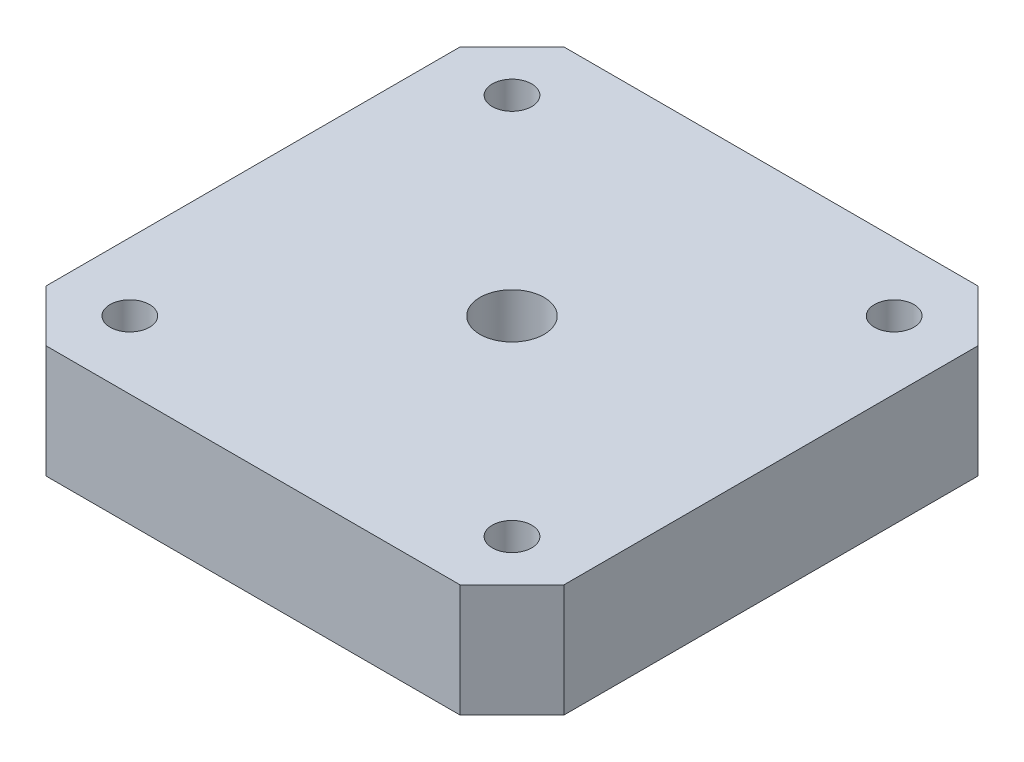
ISO-10303-21;
HEADER;
FILE_DESCRIPTION(('STEP AP214'),'2;1');
FILE_NAME('part.step','',(''),(''),'','','');
FILE_SCHEMA(('AUTOMOTIVE_DESIGN { 1 0 10303 214 1 1 1 1 }'));
ENDSEC;
DATA;
#1=APPLICATION_CONTEXT('core data for automotive mechanical design processes');
#2=APPLICATION_PROTOCOL_DEFINITION('international standard','automotive_design',2000,#1);
#3=PRODUCT_CONTEXT('',#1,'mechanical');
#4=PRODUCT('Part','Part','',(#3));
#5=PRODUCT_RELATED_PRODUCT_CATEGORY('part','',(#4));
#6=PRODUCT_DEFINITION_FORMATION('','',#4);
#7=PRODUCT_DEFINITION_CONTEXT('part definition',#1,'design');
#8=PRODUCT_DEFINITION('design','',#6,#7);
#9=PRODUCT_DEFINITION_SHAPE('','',#8);
#10=(LENGTH_UNIT() NAMED_UNIT(*) SI_UNIT(.MILLI.,.METRE.));
#11=(NAMED_UNIT(*) PLANE_ANGLE_UNIT() SI_UNIT($,.RADIAN.));
#12=(NAMED_UNIT(*) SI_UNIT($,.STERADIAN.) SOLID_ANGLE_UNIT());
#13=UNCERTAINTY_MEASURE_WITH_UNIT(LENGTH_MEASURE(1.E-05),#10,'distance_accuracy_value','');
#14=(GEOMETRIC_REPRESENTATION_CONTEXT(3) GLOBAL_UNCERTAINTY_ASSIGNED_CONTEXT((#13)) GLOBAL_UNIT_ASSIGNED_CONTEXT((#10,
#11,#12)) REPRESENTATION_CONTEXT('',''));
#15=CARTESIAN_POINT('',(0.,0.,0.));
#16=DIRECTION('',(0.,0.,1.));
#17=DIRECTION('',(1.,0.,0.));
#18=AXIS2_PLACEMENT_3D('',#15,#16,#17);
#19=CARTESIAN_POINT('',(0.,9.15,0.));
#20=DIRECTION('',(0.,-1.,0.));
#21=DIRECTION('',(0.,0.,-1.));
#22=AXIS2_PLACEMENT_3D('',#19,#20,#21);
#23=CYLINDRICAL_SURFACE('',#22,2.6);
#24=CARTESIAN_POINT('',(0.,9.15,0.));
#25=DIRECTION('',(0.,1.,0.));
#26=DIRECTION('',(0.,0.,1.));
#27=AXIS2_PLACEMENT_3D('',#24,#25,#26);
#28=CIRCLE('',#27,2.6);
#29=CARTESIAN_POINT('',(0.,9.15,2.6));
#30=VERTEX_POINT('',#29);
#31=EDGE_CURVE('E200',#30,#30,#28,.T.);
#32=ORIENTED_EDGE('',*,*,#31,.T.);
#33=EDGE_LOOP('',(#32));
#34=FACE_BOUND('',#33,.T.);
#35=CARTESIAN_POINT('',(0.,3.6,0.));
#36=DIRECTION('',(0.,-1.,0.));
#37=DIRECTION('',(0.,0.,-1.));
#38=AXIS2_PLACEMENT_3D('',#35,#36,#37);
#39=CIRCLE('',#38,2.6);
#40=CARTESIAN_POINT('',(0.,3.6,-2.6));
#41=VERTEX_POINT('',#40);
#42=EDGE_CURVE('E42',#41,#41,#39,.T.);
#43=ORIENTED_EDGE('',*,*,#42,.T.);
#44=EDGE_LOOP('',(#43));
#45=FACE_BOUND('',#44,.T.);
#46=ADVANCED_FACE('F37',(#34,#45),#23,.F.);
#47=CARTESIAN_POINT('',(0.,9.15,0.));
#48=DIRECTION('',(0.,-1.,0.));
#49=DIRECTION('',(0.,0.,-1.));
#50=AXIS2_PLACEMENT_3D('',#47,#48,#49);
#51=PLANE('',#50);
#52=DIRECTION('',(-1.,0.,0.));
#53=VECTOR('',#52,1.);
#54=CARTESIAN_POINT('',(-21.,9.15,-21.));
#55=LINE('',#54,#53);
#56=CARTESIAN_POINT('',(16.8,9.15,-21.));
#57=VERTEX_POINT('',#56);
#58=CARTESIAN_POINT('',(-16.8,9.15,-21.));
#59=VERTEX_POINT('',#58);
#60=EDGE_CURVE('E178',#57,#59,#55,.T.);
#61=ORIENTED_EDGE('',*,*,#60,.T.);
#62=DIRECTION('',(0.707106781186549,0.,-0.707106781186546));
#63=VECTOR('',#62,1.);
#64=CARTESIAN_POINT('',(-21.,9.15,-16.8));
#65=LINE('',#64,#63);
#66=CARTESIAN_POINT('',(-21.,9.15,-16.8));
#67=VERTEX_POINT('',#66);
#68=EDGE_CURVE('E154',#59,#67,#65,.F.);
#69=ORIENTED_EDGE('',*,*,#68,.T.);
#70=DIRECTION('',(0.,0.,1.));
#71=VECTOR('',#70,1.);
#72=CARTESIAN_POINT('',(-21.,9.15,21.));
#73=LINE('',#72,#71);
#74=CARTESIAN_POINT('',(-21.,9.15,16.8));
#75=VERTEX_POINT('',#74);
#76=EDGE_CURVE('E124',#67,#75,#73,.T.);
#77=ORIENTED_EDGE('',*,*,#76,.T.);
#78=DIRECTION('',(-0.707106781186546,0.,-0.707106781186549));
#79=VECTOR('',#78,1.);
#80=CARTESIAN_POINT('',(-16.8,9.15,21.));
#81=LINE('',#80,#79);
#82=CARTESIAN_POINT('',(-16.8,9.15,21.));
#83=VERTEX_POINT('',#82);
#84=EDGE_CURVE('E61',#75,#83,#81,.F.);
#85=ORIENTED_EDGE('',*,*,#84,.T.);
#86=DIRECTION('',(1.,0.,0.));
#87=VECTOR('',#86,1.);
#88=CARTESIAN_POINT('',(-21.,9.15,21.));
#89=LINE('',#88,#87);
#90=CARTESIAN_POINT('',(16.8,9.15,21.));
#91=VERTEX_POINT('',#90);
#92=EDGE_CURVE('E140',#83,#91,#89,.T.);
#93=ORIENTED_EDGE('',*,*,#92,.T.);
#94=DIRECTION('',(-0.707106781186549,0.,0.707106781186546));
#95=VECTOR('',#94,1.);
#96=CARTESIAN_POINT('',(21.,9.15,16.8));
#97=LINE('',#96,#95);
#98=CARTESIAN_POINT('',(21.,9.15,16.8));
#99=VERTEX_POINT('',#98);
#100=EDGE_CURVE('E149',#91,#99,#97,.F.);
#101=ORIENTED_EDGE('',*,*,#100,.T.);
#102=DIRECTION('',(0.,0.,-1.));
#103=VECTOR('',#102,1.);
#104=CARTESIAN_POINT('',(21.,9.15,21.));
#105=LINE('',#104,#103);
#106=CARTESIAN_POINT('',(21.,9.15,-16.8));
#107=VERTEX_POINT('',#106);
#108=EDGE_CURVE('E134',#99,#107,#105,.T.);
#109=ORIENTED_EDGE('',*,*,#108,.T.);
#110=DIRECTION('',(0.707106781186546,0.,0.707106781186549));
#111=VECTOR('',#110,1.);
#112=CARTESIAN_POINT('',(16.8,9.15,-21.));
#113=LINE('',#112,#111);
#114=EDGE_CURVE('E151',#107,#57,#113,.F.);
#115=ORIENTED_EDGE('',*,*,#114,.T.);
#116=EDGE_LOOP('',(#61,#69,#77,#85,#93,#101,#109,#115));
#117=FACE_BOUND('',#116,.T.);
#118=CARTESIAN_POINT('',(-15.5,9.15,-15.5));
#119=DIRECTION('',(0.,1.,0.));
#120=DIRECTION('',(0.,0.,1.));
#121=AXIS2_PLACEMENT_3D('',#118,#119,#120);
#122=CIRCLE('',#121,1.6);
#123=CARTESIAN_POINT('',(-15.5,9.15,-13.9));
#124=VERTEX_POINT('',#123);
#125=EDGE_CURVE('E171',#124,#124,#122,.T.);
#126=ORIENTED_EDGE('',*,*,#125,.F.);
#127=EDGE_LOOP('',(#126));
#128=FACE_BOUND('',#127,.T.);
#129=CARTESIAN_POINT('',(15.5,9.15,-15.5));
#130=DIRECTION('',(0.,1.,0.));
#131=DIRECTION('',(0.,0.,1.));
#132=AXIS2_PLACEMENT_3D('',#129,#130,#131);
#133=CIRCLE('',#132,1.6);
#134=CARTESIAN_POINT('',(15.5,9.15,-13.9));
#135=VERTEX_POINT('',#134);
#136=EDGE_CURVE('E183',#135,#135,#133,.T.);
#137=ORIENTED_EDGE('',*,*,#136,.F.);
#138=EDGE_LOOP('',(#137));
#139=FACE_BOUND('',#138,.T.);
#140=CARTESIAN_POINT('',(15.5,9.15,15.5));
#141=DIRECTION('',(0.,1.,0.));
#142=DIRECTION('',(0.,0.,1.));
#143=AXIS2_PLACEMENT_3D('',#140,#141,#142);
#144=CIRCLE('',#143,1.6);
#145=CARTESIAN_POINT('',(15.5,9.15,17.1));
#146=VERTEX_POINT('',#145);
#147=EDGE_CURVE('E188',#146,#146,#144,.T.);
#148=ORIENTED_EDGE('',*,*,#147,.F.);
#149=EDGE_LOOP('',(#148));
#150=FACE_BOUND('',#149,.T.);
#151=CARTESIAN_POINT('',(-15.5,9.15,15.5));
#152=DIRECTION('',(0.,1.,0.));
#153=DIRECTION('',(0.,0.,1.));
#154=AXIS2_PLACEMENT_3D('',#151,#152,#153);
#155=CIRCLE('',#154,1.6);
#156=CARTESIAN_POINT('',(-15.5,9.15,17.1));
#157=VERTEX_POINT('',#156);
#158=EDGE_CURVE('E194',#157,#157,#155,.T.);
#159=ORIENTED_EDGE('',*,*,#158,.F.);
#160=EDGE_LOOP('',(#159));
#161=FACE_BOUND('',#160,.T.);
#162=ORIENTED_EDGE('',*,*,#31,.F.);
#163=EDGE_LOOP('',(#162));
#164=FACE_BOUND('',#163,.T.);
#165=ADVANCED_FACE('F232',(#117,#128,#139,#150,#161,#164),#51,.F.);
#166=CARTESIAN_POINT('',(0.,0.,0.));
#167=DIRECTION('',(0.,-1.,0.));
#168=DIRECTION('',(0.,0.,-1.));
#169=AXIS2_PLACEMENT_3D('',#166,#167,#168);
#170=PLANE('',#169);
#171=CARTESIAN_POINT('',(0.,0.,0.));
#172=DIRECTION('',(0.,-1.,0.));
#173=DIRECTION('',(0.,0.,-1.));
#174=AXIS2_PLACEMENT_3D('',#171,#172,#173);
#175=CIRCLE('',#174,5.15);
#176=CARTESIAN_POINT('',(0.,0.,-5.15));
#177=VERTEX_POINT('',#176);
#178=EDGE_CURVE('E206',#177,#177,#175,.T.);
#179=ORIENTED_EDGE('',*,*,#178,.F.);
#180=EDGE_LOOP('',(#179));
#181=FACE_BOUND('',#180,.T.);
#182=CARTESIAN_POINT('',(-15.5,0.,15.5));
#183=DIRECTION('',(0.,1.,0.));
#184=DIRECTION('',(0.,0.,1.));
#185=AXIS2_PLACEMENT_3D('',#182,#183,#184);
#186=CIRCLE('',#185,1.6);
#187=CARTESIAN_POINT('',(-15.5,0.,17.1));
#188=VERTEX_POINT('',#187);
#189=EDGE_CURVE('E197',#188,#188,#186,.T.);
#190=ORIENTED_EDGE('',*,*,#189,.T.);
#191=EDGE_LOOP('',(#190));
#192=FACE_BOUND('',#191,.T.);
#193=CARTESIAN_POINT('',(15.5,0.,-15.5));
#194=DIRECTION('',(0.,1.,0.));
#195=DIRECTION('',(0.,0.,1.));
#196=AXIS2_PLACEMENT_3D('',#193,#194,#195);
#197=CIRCLE('',#196,1.6);
#198=CARTESIAN_POINT('',(15.5,0.,-13.9));
#199=VERTEX_POINT('',#198);
#200=EDGE_CURVE('E185',#199,#199,#197,.T.);
#201=ORIENTED_EDGE('',*,*,#200,.T.);
#202=EDGE_LOOP('',(#201));
#203=FACE_BOUND('',#202,.T.);
#204=DIRECTION('',(0.,0.,1.));
#205=VECTOR('',#204,1.);
#206=CARTESIAN_POINT('',(-21.,0.,21.));
#207=LINE('',#206,#205);
#208=CARTESIAN_POINT('',(-21.,0.,-16.8));
#209=VERTEX_POINT('',#208);
#210=CARTESIAN_POINT('',(-21.,0.,16.8));
#211=VERTEX_POINT('',#210);
#212=EDGE_CURVE('E122',#209,#211,#207,.T.);
#213=ORIENTED_EDGE('',*,*,#212,.F.);
#214=DIRECTION('',(-0.707106781186549,0.,0.707106781186546));
#215=VECTOR('',#214,1.);
#216=CARTESIAN_POINT('',(-18.9,0.,-18.9));
#217=LINE('',#216,#215);
#218=CARTESIAN_POINT('',(-16.8,0.,-21.));
#219=VERTEX_POINT('',#218);
#220=EDGE_CURVE('E105',#209,#219,#217,.F.);
#221=ORIENTED_EDGE('',*,*,#220,.T.);
#222=DIRECTION('',(-1.,0.,0.));
#223=VECTOR('',#222,1.);
#224=CARTESIAN_POINT('',(-21.,0.,-21.));
#225=LINE('',#224,#223);
#226=CARTESIAN_POINT('',(16.8,0.,-21.));
#227=VERTEX_POINT('',#226);
#228=EDGE_CURVE('E132',#227,#219,#225,.T.);
#229=ORIENTED_EDGE('',*,*,#228,.F.);
#230=DIRECTION('',(-0.707106781186546,0.,-0.707106781186549));
#231=VECTOR('',#230,1.);
#232=CARTESIAN_POINT('',(18.9,0.,-18.8999999999999));
#233=LINE('',#232,#231);
#234=CARTESIAN_POINT('',(21.,0.,-16.8));
#235=VERTEX_POINT('',#234);
#236=EDGE_CURVE('E143',#227,#235,#233,.F.);
#237=ORIENTED_EDGE('',*,*,#236,.T.);
#238=DIRECTION('',(0.,0.,-1.));
#239=VECTOR('',#238,1.);
#240=CARTESIAN_POINT('',(21.,0.,21.));
#241=LINE('',#240,#239);
#242=CARTESIAN_POINT('',(21.,0.,16.8));
#243=VERTEX_POINT('',#242);
#244=EDGE_CURVE('E136',#243,#235,#241,.T.);
#245=ORIENTED_EDGE('',*,*,#244,.F.);
#246=DIRECTION('',(0.707106781186549,0.,-0.707106781186546));
#247=VECTOR('',#246,1.);
#248=CARTESIAN_POINT('',(18.9,0.,18.9));
#249=LINE('',#248,#247);
#250=CARTESIAN_POINT('',(16.8,0.,21.));
#251=VERTEX_POINT('',#250);
#252=EDGE_CURVE('E125',#243,#251,#249,.F.);
#253=ORIENTED_EDGE('',*,*,#252,.T.);
#254=DIRECTION('',(1.,0.,0.));
#255=VECTOR('',#254,1.);
#256=CARTESIAN_POINT('',(-21.,0.,21.));
#257=LINE('',#256,#255);
#258=CARTESIAN_POINT('',(-16.8,0.,21.));
#259=VERTEX_POINT('',#258);
#260=EDGE_CURVE('E131',#259,#251,#257,.T.);
#261=ORIENTED_EDGE('',*,*,#260,.F.);
#262=DIRECTION('',(0.707106781186546,0.,0.707106781186549));
#263=VECTOR('',#262,1.);
#264=CARTESIAN_POINT('',(-18.9,0.,18.9));
#265=LINE('',#264,#263);
#266=EDGE_CURVE('E116',#259,#211,#265,.F.);
#267=ORIENTED_EDGE('',*,*,#266,.T.);
#268=EDGE_LOOP('',(#213,#221,#229,#237,#245,#253,#261,#267));
#269=FACE_BOUND('',#268,.T.);
#270=CARTESIAN_POINT('',(-15.5,0.,-15.5));
#271=DIRECTION('',(0.,1.,0.));
#272=DIRECTION('',(0.,0.,1.));
#273=AXIS2_PLACEMENT_3D('',#270,#271,#272);
#274=CIRCLE('',#273,1.6);
#275=CARTESIAN_POINT('',(-15.5,0.,-13.9));
#276=VERTEX_POINT('',#275);
#277=EDGE_CURVE('E173',#276,#276,#274,.T.);
#278=ORIENTED_EDGE('',*,*,#277,.T.);
#279=EDGE_LOOP('',(#278));
#280=FACE_BOUND('',#279,.T.);
#281=CARTESIAN_POINT('',(15.5,0.,15.5));
#282=DIRECTION('',(0.,1.,0.));
#283=DIRECTION('',(0.,0.,1.));
#284=AXIS2_PLACEMENT_3D('',#281,#282,#283);
#285=CIRCLE('',#284,1.6);
#286=CARTESIAN_POINT('',(15.5,0.,17.1));
#287=VERTEX_POINT('',#286);
#288=EDGE_CURVE('E191',#287,#287,#285,.T.);
#289=ORIENTED_EDGE('',*,*,#288,.T.);
#290=EDGE_LOOP('',(#289));
#291=FACE_BOUND('',#290,.T.);
#292=ADVANCED_FACE('F128',(#181,#192,#203,#269,#280,#291),#170,.T.);
#293=CARTESIAN_POINT('',(21.,9.15,21.));
#294=DIRECTION('',(-1.,0.,0.));
#295=DIRECTION('',(0.,0.,1.));
#296=AXIS2_PLACEMENT_3D('',#293,#294,#295);
#297=PLANE('',#296);
#298=ORIENTED_EDGE('',*,*,#244,.T.);
#299=DIRECTION('',(0.,1.,0.));
#300=VECTOR('',#299,1.);
#301=CARTESIAN_POINT('',(21.,9.15,-16.8));
#302=LINE('',#301,#300);
#303=EDGE_CURVE('E11',#235,#107,#302,.T.);
#304=ORIENTED_EDGE('',*,*,#303,.T.);
#305=ORIENTED_EDGE('',*,*,#108,.F.);
#306=DIRECTION('',(0.,-1.,0.));
#307=VECTOR('',#306,1.);
#308=CARTESIAN_POINT('',(21.,9.15,16.8));
#309=LINE('',#308,#307);
#310=EDGE_CURVE('E47',#99,#243,#309,.T.);
#311=ORIENTED_EDGE('',*,*,#310,.T.);
#312=EDGE_LOOP('',(#298,#304,#305,#311));
#313=FACE_BOUND('',#312,.T.);
#314=ADVANCED_FACE('F166',(#313),#297,.F.);
#315=CARTESIAN_POINT('',(-21.,9.15,-21.));
#316=DIRECTION('',(0.,0.,1.));
#317=DIRECTION('',(1.,0.,0.));
#318=AXIS2_PLACEMENT_3D('',#315,#316,#317);
#319=PLANE('',#318);
#320=ORIENTED_EDGE('',*,*,#228,.T.);
#321=DIRECTION('',(0.,1.,0.));
#322=VECTOR('',#321,1.);
#323=CARTESIAN_POINT('',(-16.8,9.15,-21.));
#324=LINE('',#323,#322);
#325=EDGE_CURVE('E110',#219,#59,#324,.T.);
#326=ORIENTED_EDGE('',*,*,#325,.T.);
#327=ORIENTED_EDGE('',*,*,#60,.F.);
#328=DIRECTION('',(0.,-1.,0.));
#329=VECTOR('',#328,1.);
#330=CARTESIAN_POINT('',(16.8,9.15,-21.));
#331=LINE('',#330,#329);
#332=EDGE_CURVE('E115',#57,#227,#331,.T.);
#333=ORIENTED_EDGE('',*,*,#332,.T.);
#334=EDGE_LOOP('',(#320,#326,#327,#333));
#335=FACE_BOUND('',#334,.T.);
#336=ADVANCED_FACE('F267',(#335),#319,.F.);
#337=CARTESIAN_POINT('',(-21.,9.15,21.));
#338=DIRECTION('',(1.,0.,0.));
#339=DIRECTION('',(0.,0.,-1.));
#340=AXIS2_PLACEMENT_3D('',#337,#338,#339);
#341=PLANE('',#340);
#342=ORIENTED_EDGE('',*,*,#76,.F.);
#343=DIRECTION('',(0.,-1.,0.));
#344=VECTOR('',#343,1.);
#345=CARTESIAN_POINT('',(-21.,9.15,-16.8));
#346=LINE('',#345,#344);
#347=EDGE_CURVE('E109',#67,#209,#346,.T.);
#348=ORIENTED_EDGE('',*,*,#347,.T.);
#349=ORIENTED_EDGE('',*,*,#212,.T.);
#350=DIRECTION('',(0.,1.,0.));
#351=VECTOR('',#350,1.);
#352=CARTESIAN_POINT('',(-21.,9.15,16.8));
#353=LINE('',#352,#351);
#354=EDGE_CURVE('E126',#211,#75,#353,.T.);
#355=ORIENTED_EDGE('',*,*,#354,.T.);
#356=EDGE_LOOP('',(#342,#348,#349,#355));
#357=FACE_BOUND('',#356,.T.);
#358=ADVANCED_FACE('F121',(#357),#341,.F.);
#359=CARTESIAN_POINT('',(-21.,9.15,21.));
#360=DIRECTION('',(0.,0.,-1.));
#361=DIRECTION('',(-1.,0.,0.));
#362=AXIS2_PLACEMENT_3D('',#359,#360,#361);
#363=PLANE('',#362);
#364=ORIENTED_EDGE('',*,*,#92,.F.);
#365=DIRECTION('',(0.,-1.,0.));
#366=VECTOR('',#365,1.);
#367=CARTESIAN_POINT('',(-16.8,9.15,21.));
#368=LINE('',#367,#366);
#369=EDGE_CURVE('E157',#83,#259,#368,.T.);
#370=ORIENTED_EDGE('',*,*,#369,.T.);
#371=ORIENTED_EDGE('',*,*,#260,.T.);
#372=DIRECTION('',(0.,1.,0.));
#373=VECTOR('',#372,1.);
#374=CARTESIAN_POINT('',(16.8,9.15,21.));
#375=LINE('',#374,#373);
#376=EDGE_CURVE('E54',#251,#91,#375,.T.);
#377=ORIENTED_EDGE('',*,*,#376,.T.);
#378=EDGE_LOOP('',(#364,#370,#371,#377));
#379=FACE_BOUND('',#378,.T.);
#380=ADVANCED_FACE('F257',(#379),#363,.F.);
#381=CARTESIAN_POINT('',(-15.5,9.15,-15.5));
#382=DIRECTION('',(0.,-1.,0.));
#383=DIRECTION('',(0.,0.,-1.));
#384=AXIS2_PLACEMENT_3D('',#381,#382,#383);
#385=CYLINDRICAL_SURFACE('',#384,1.6);
#386=ORIENTED_EDGE('',*,*,#125,.T.);
#387=EDGE_LOOP('',(#386));
#388=FACE_BOUND('',#387,.T.);
#389=ORIENTED_EDGE('',*,*,#277,.F.);
#390=EDGE_LOOP('',(#389));
#391=FACE_BOUND('',#390,.T.);
#392=ADVANCED_FACE('F254',(#388,#391),#385,.F.);
#393=CARTESIAN_POINT('',(15.5,9.15,-15.5));
#394=DIRECTION('',(0.,-1.,0.));
#395=DIRECTION('',(0.,0.,-1.));
#396=AXIS2_PLACEMENT_3D('',#393,#394,#395);
#397=CYLINDRICAL_SURFACE('',#396,1.6);
#398=ORIENTED_EDGE('',*,*,#136,.T.);
#399=EDGE_LOOP('',(#398));
#400=FACE_BOUND('',#399,.T.);
#401=ORIENTED_EDGE('',*,*,#200,.F.);
#402=EDGE_LOOP('',(#401));
#403=FACE_BOUND('',#402,.T.);
#404=ADVANCED_FACE('F250',(#400,#403),#397,.F.);
#405=CARTESIAN_POINT('',(15.5,9.15,15.5));
#406=DIRECTION('',(0.,-1.,0.));
#407=DIRECTION('',(0.,0.,-1.));
#408=AXIS2_PLACEMENT_3D('',#405,#406,#407);
#409=CYLINDRICAL_SURFACE('',#408,1.6);
#410=ORIENTED_EDGE('',*,*,#147,.T.);
#411=EDGE_LOOP('',(#410));
#412=FACE_BOUND('',#411,.T.);
#413=ORIENTED_EDGE('',*,*,#288,.F.);
#414=EDGE_LOOP('',(#413));
#415=FACE_BOUND('',#414,.T.);
#416=ADVANCED_FACE('F246',(#412,#415),#409,.F.);
#417=CARTESIAN_POINT('',(-15.5,9.15,15.5));
#418=DIRECTION('',(0.,-1.,0.));
#419=DIRECTION('',(0.,0.,-1.));
#420=AXIS2_PLACEMENT_3D('',#417,#418,#419);
#421=CYLINDRICAL_SURFACE('',#420,1.6);
#422=ORIENTED_EDGE('',*,*,#158,.T.);
#423=EDGE_LOOP('',(#422));
#424=FACE_BOUND('',#423,.T.);
#425=ORIENTED_EDGE('',*,*,#189,.F.);
#426=EDGE_LOOP('',(#425));
#427=FACE_BOUND('',#426,.T.);
#428=ADVANCED_FACE('F243',(#424,#427),#421,.F.);
#429=CARTESIAN_POINT('',(0.,0.6,0.));
#430=DIRECTION('',(0.,-1.,0.));
#431=DIRECTION('',(0.,0.,-1.));
#432=AXIS2_PLACEMENT_3D('',#429,#430,#431);
#433=CYLINDRICAL_SURFACE('',#432,5.15);
#434=CARTESIAN_POINT('',(0.,0.6,0.));
#435=DIRECTION('',(0.,-1.,0.));
#436=DIRECTION('',(0.,0.,-1.));
#437=AXIS2_PLACEMENT_3D('',#434,#435,#436);
#438=CIRCLE('',#437,5.15);
#439=CARTESIAN_POINT('',(0.,0.6,-5.15));
#440=VERTEX_POINT('',#439);
#441=EDGE_CURVE('E205',#440,#440,#438,.T.);
#442=ORIENTED_EDGE('',*,*,#441,.F.);
#443=EDGE_LOOP('',(#442));
#444=FACE_BOUND('',#443,.T.);
#445=ORIENTED_EDGE('',*,*,#178,.T.);
#446=EDGE_LOOP('',(#445));
#447=FACE_BOUND('',#446,.T.);
#448=ADVANCED_FACE('F241',(#444,#447),#433,.F.);
#449=CARTESIAN_POINT('',(0.,0.6,0.));
#450=DIRECTION('',(0.,-1.,0.));
#451=DIRECTION('',(0.,0.,-1.));
#452=AXIS2_PLACEMENT_3D('',#449,#450,#451);
#453=PLANE('',#452);
#454=CARTESIAN_POINT('',(0.,0.6,0.));
#455=DIRECTION('',(0.,-1.,0.));
#456=DIRECTION('',(0.,0.,-1.));
#457=AXIS2_PLACEMENT_3D('',#454,#455,#456);
#458=CIRCLE('',#457,4.6);
#459=CARTESIAN_POINT('',(0.,0.6,-4.6));
#460=VERTEX_POINT('',#459);
#461=EDGE_CURVE('E211',#460,#460,#458,.T.);
#462=ORIENTED_EDGE('',*,*,#461,.F.);
#463=EDGE_LOOP('',(#462));
#464=FACE_BOUND('',#463,.T.);
#465=ORIENTED_EDGE('',*,*,#441,.T.);
#466=EDGE_LOOP('',(#465));
#467=FACE_BOUND('',#466,.T.);
#468=ADVANCED_FACE('F280',(#464,#467),#453,.T.);
#469=CARTESIAN_POINT('',(-21.,9.15,-16.8));
#470=DIRECTION('',(0.707106781186546,0.,0.707106781186549));
#471=DIRECTION('',(0.,-1.,0.));
#472=AXIS2_PLACEMENT_3D('',#469,#470,#471);
#473=PLANE('',#472);
#474=ORIENTED_EDGE('',*,*,#68,.F.);
#475=ORIENTED_EDGE('',*,*,#325,.F.);
#476=ORIENTED_EDGE('',*,*,#220,.F.);
#477=ORIENTED_EDGE('',*,*,#347,.F.);
#478=EDGE_LOOP('',(#474,#475,#476,#477));
#479=FACE_BOUND('',#478,.T.);
#480=ADVANCED_FACE('F108',(#479),#473,.F.);
#481=CARTESIAN_POINT('',(-16.8,9.15,21.));
#482=DIRECTION('',(0.707106781186549,0.,-0.707106781186546));
#483=DIRECTION('',(0.,-1.,0.));
#484=AXIS2_PLACEMENT_3D('',#481,#482,#483);
#485=PLANE('',#484);
#486=ORIENTED_EDGE('',*,*,#84,.F.);
#487=ORIENTED_EDGE('',*,*,#354,.F.);
#488=ORIENTED_EDGE('',*,*,#266,.F.);
#489=ORIENTED_EDGE('',*,*,#369,.F.);
#490=EDGE_LOOP('',(#486,#487,#488,#489));
#491=FACE_BOUND('',#490,.T.);
#492=ADVANCED_FACE('F279',(#491),#485,.F.);
#493=CARTESIAN_POINT('',(16.8,9.15,-21.));
#494=DIRECTION('',(-0.707106781186549,0.,0.707106781186546));
#495=DIRECTION('',(0.,-1.,0.));
#496=AXIS2_PLACEMENT_3D('',#493,#494,#495);
#497=PLANE('',#496);
#498=ORIENTED_EDGE('',*,*,#114,.F.);
#499=ORIENTED_EDGE('',*,*,#303,.F.);
#500=ORIENTED_EDGE('',*,*,#236,.F.);
#501=ORIENTED_EDGE('',*,*,#332,.F.);
#502=EDGE_LOOP('',(#498,#499,#500,#501));
#503=FACE_BOUND('',#502,.T.);
#504=ADVANCED_FACE('F285',(#503),#497,.F.);
#505=CARTESIAN_POINT('',(21.,9.15,16.8));
#506=DIRECTION('',(-0.707106781186546,0.,-0.707106781186549));
#507=DIRECTION('',(0.,-1.,0.));
#508=AXIS2_PLACEMENT_3D('',#505,#506,#507);
#509=PLANE('',#508);
#510=ORIENTED_EDGE('',*,*,#100,.F.);
#511=ORIENTED_EDGE('',*,*,#376,.F.);
#512=ORIENTED_EDGE('',*,*,#252,.F.);
#513=ORIENTED_EDGE('',*,*,#310,.F.);
#514=EDGE_LOOP('',(#510,#511,#512,#513));
#515=FACE_BOUND('',#514,.T.);
#516=ADVANCED_FACE('F40',(#515),#509,.F.);
#517=CARTESIAN_POINT('',(0.,3.6,0.));
#518=DIRECTION('',(0.,-1.,0.));
#519=DIRECTION('',(0.,0.,-1.));
#520=AXIS2_PLACEMENT_3D('',#517,#518,#519);
#521=CYLINDRICAL_SURFACE('',#520,4.6);
#522=CARTESIAN_POINT('',(0.,3.6,0.));
#523=DIRECTION('',(0.,-1.,0.));
#524=DIRECTION('',(0.,0.,-1.));
#525=AXIS2_PLACEMENT_3D('',#522,#523,#524);
#526=CIRCLE('',#525,4.6);
#527=CARTESIAN_POINT('',(0.,3.6,-4.6));
#528=VERTEX_POINT('',#527);
#529=EDGE_CURVE('E214',#528,#528,#526,.T.);
#530=ORIENTED_EDGE('',*,*,#529,.F.);
#531=EDGE_LOOP('',(#530));
#532=FACE_BOUND('',#531,.T.);
#533=ORIENTED_EDGE('',*,*,#461,.T.);
#534=EDGE_LOOP('',(#533));
#535=FACE_BOUND('',#534,.T.);
#536=ADVANCED_FACE('F224',(#532,#535),#521,.F.);
#537=CARTESIAN_POINT('',(0.,3.6,0.));
#538=DIRECTION('',(0.,-1.,0.));
#539=DIRECTION('',(0.,0.,-1.));
#540=AXIS2_PLACEMENT_3D('',#537,#538,#539);
#541=PLANE('',#540);
#542=ORIENTED_EDGE('',*,*,#42,.F.);
#543=EDGE_LOOP('',(#542));
#544=FACE_BOUND('',#543,.T.);
#545=ORIENTED_EDGE('',*,*,#529,.T.);
#546=EDGE_LOOP('',(#545));
#547=FACE_BOUND('',#546,.T.);
#548=ADVANCED_FACE('F222',(#544,#547),#541,.T.);
#549=CLOSED_SHELL('',(#46,#165,#292,#314,#336,#358,#380,#392,#404,#416,#428,#448,#468,#480,#492,
#504,#516,#536,#548));
#550=MANIFOLD_SOLID_BREP('B2',#549);
#551=ADVANCED_BREP_SHAPE_REPRESENTATION('',(#18,#550),#14);
#552=SHAPE_DEFINITION_REPRESENTATION(#9,#551);
ENDSEC;
END-ISO-10303-21;
